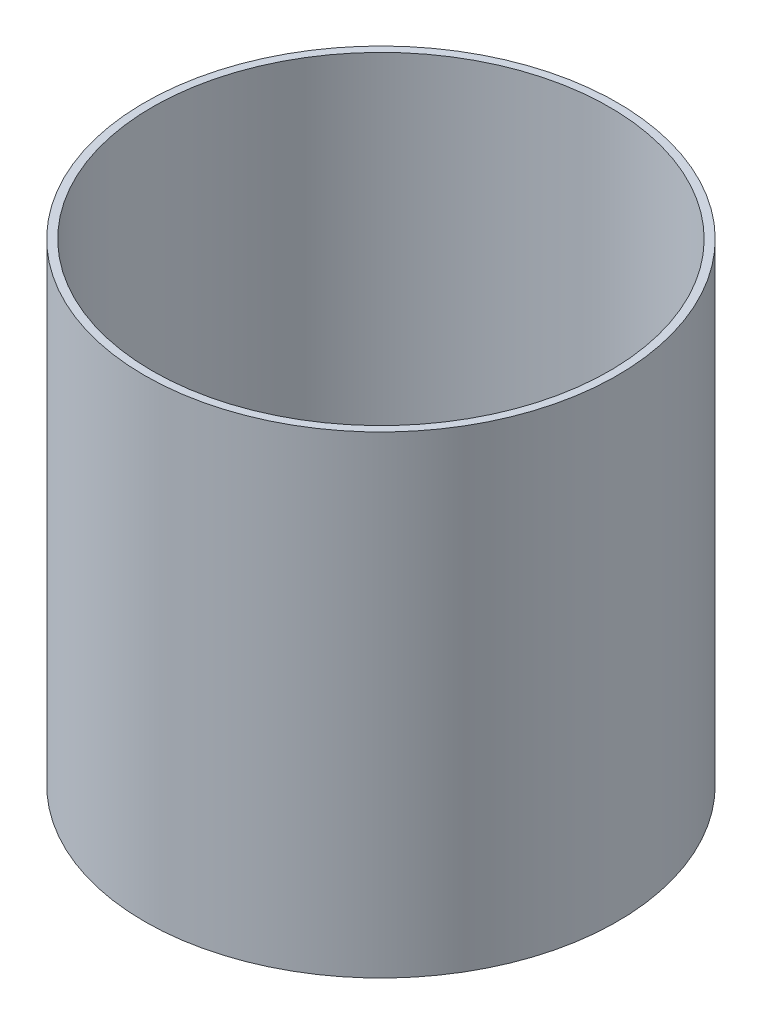
ISO-10303-21;
HEADER;
FILE_DESCRIPTION(('STEP AP214'),'2;1');
FILE_NAME('part.step','',(''),(''),'','','');
FILE_SCHEMA(('AUTOMOTIVE_DESIGN { 1 0 10303 214 1 1 1 1 }'));
ENDSEC;
DATA;
#1=APPLICATION_CONTEXT('core data for automotive mechanical design processes');
#2=APPLICATION_PROTOCOL_DEFINITION('international standard','automotive_design',2000,#1);
#3=PRODUCT_CONTEXT('',#1,'mechanical');
#4=PRODUCT('Part','Part','',(#3));
#5=PRODUCT_RELATED_PRODUCT_CATEGORY('part','',(#4));
#6=PRODUCT_DEFINITION_FORMATION('','',#4);
#7=PRODUCT_DEFINITION_CONTEXT('part definition',#1,'design');
#8=PRODUCT_DEFINITION('design','',#6,#7);
#9=PRODUCT_DEFINITION_SHAPE('','',#8);
#10=(LENGTH_UNIT() NAMED_UNIT(*) SI_UNIT(.MILLI.,.METRE.));
#11=(NAMED_UNIT(*) PLANE_ANGLE_UNIT() SI_UNIT($,.RADIAN.));
#12=(NAMED_UNIT(*) SI_UNIT($,.STERADIAN.) SOLID_ANGLE_UNIT());
#13=UNCERTAINTY_MEASURE_WITH_UNIT(LENGTH_MEASURE(1.E-05),#10,'distance_accuracy_value','');
#14=(GEOMETRIC_REPRESENTATION_CONTEXT(3) GLOBAL_UNCERTAINTY_ASSIGNED_CONTEXT((#13)) GLOBAL_UNIT_ASSIGNED_CONTEXT((#10,
#11,#12)) REPRESENTATION_CONTEXT('',''));
#15=CARTESIAN_POINT('',(0.,0.,0.));
#16=DIRECTION('',(0.,0.,1.));
#17=DIRECTION('',(1.,0.,0.));
#18=AXIS2_PLACEMENT_3D('',#15,#16,#17);
#19=CARTESIAN_POINT('',(0.,152.4,0.));
#20=DIRECTION('',(0.,1.,0.));
#21=DIRECTION('',(0.,0.,1.));
#22=AXIS2_PLACEMENT_3D('',#19,#20,#21);
#23=PLANE('',#22);
#24=CARTESIAN_POINT('',(0.,152.4,0.));
#25=DIRECTION('',(0.,1.,0.));
#26=DIRECTION('',(0.,0.,1.));
#27=AXIS2_PLACEMENT_3D('',#24,#25,#26);
#28=CIRCLE('',#27,76.1746);
#29=CARTESIAN_POINT('',(0.,152.4,76.1746));
#30=VERTEX_POINT('',#29);
#31=EDGE_CURVE('E10',#30,#30,#28,.T.);
#32=ORIENTED_EDGE('',*,*,#31,.T.);
#33=EDGE_LOOP('',(#32));
#34=FACE_BOUND('',#33,.T.);
#35=CARTESIAN_POINT('',(0.,152.4,0.));
#36=DIRECTION('',(0.,1.,0.));
#37=DIRECTION('',(0.,0.,1.));
#38=AXIS2_PLACEMENT_3D('',#35,#36,#37);
#39=CIRCLE('',#38,73.66);
#40=CARTESIAN_POINT('',(0.,152.4,73.66));
#41=VERTEX_POINT('',#40);
#42=EDGE_CURVE('E45',#41,#41,#39,.T.);
#43=ORIENTED_EDGE('',*,*,#42,.F.);
#44=EDGE_LOOP('',(#43));
#45=FACE_BOUND('',#44,.T.);
#46=ADVANCED_FACE('F34',(#34,#45),#23,.T.);
#47=CARTESIAN_POINT('',(0.,0.,0.));
#48=DIRECTION('',(0.,1.,0.));
#49=DIRECTION('',(0.,0.,1.));
#50=AXIS2_PLACEMENT_3D('',#47,#48,#49);
#51=PLANE('',#50);
#52=CARTESIAN_POINT('',(0.,0.,0.));
#53=DIRECTION('',(0.,1.,0.));
#54=DIRECTION('',(0.,0.,1.));
#55=AXIS2_PLACEMENT_3D('',#52,#53,#54);
#56=CIRCLE('',#55,76.1746);
#57=CARTESIAN_POINT('',(0.,0.,76.1746));
#58=VERTEX_POINT('',#57);
#59=EDGE_CURVE('E38',#58,#58,#56,.T.);
#60=ORIENTED_EDGE('',*,*,#59,.F.);
#61=EDGE_LOOP('',(#60));
#62=FACE_BOUND('',#61,.T.);
#63=CARTESIAN_POINT('',(0.,0.,0.));
#64=DIRECTION('',(0.,1.,0.));
#65=DIRECTION('',(0.,0.,1.));
#66=AXIS2_PLACEMENT_3D('',#63,#64,#65);
#67=CIRCLE('',#66,73.66);
#68=CARTESIAN_POINT('',(0.,0.,73.66));
#69=VERTEX_POINT('',#68);
#70=EDGE_CURVE('E47',#69,#69,#67,.T.);
#71=ORIENTED_EDGE('',*,*,#70,.T.);
#72=EDGE_LOOP('',(#71));
#73=FACE_BOUND('',#72,.T.);
#74=ADVANCED_FACE('F57',(#62,#73),#51,.F.);
#75=CARTESIAN_POINT('',(0.,152.4,0.));
#76=DIRECTION('',(0.,-1.,0.));
#77=DIRECTION('',(0.,0.,-1.));
#78=AXIS2_PLACEMENT_3D('',#75,#76,#77);
#79=CYLINDRICAL_SURFACE('',#78,76.1746);
#80=ORIENTED_EDGE('',*,*,#31,.F.);
#81=EDGE_LOOP('',(#80));
#82=FACE_BOUND('',#81,.T.);
#83=ORIENTED_EDGE('',*,*,#59,.T.);
#84=EDGE_LOOP('',(#83));
#85=FACE_BOUND('',#84,.T.);
#86=ADVANCED_FACE('F36',(#82,#85),#79,.T.);
#87=CARTESIAN_POINT('',(0.,152.4,0.));
#88=DIRECTION('',(0.,-1.,0.));
#89=DIRECTION('',(0.,0.,-1.));
#90=AXIS2_PLACEMENT_3D('',#87,#88,#89);
#91=CYLINDRICAL_SURFACE('',#90,73.66);
#92=ORIENTED_EDGE('',*,*,#42,.T.);
#93=EDGE_LOOP('',(#92));
#94=FACE_BOUND('',#93,.T.);
#95=ORIENTED_EDGE('',*,*,#70,.F.);
#96=EDGE_LOOP('',(#95));
#97=FACE_BOUND('',#96,.T.);
#98=ADVANCED_FACE('F53',(#94,#97),#91,.F.);
#99=CLOSED_SHELL('',(#46,#74,#86,#98));
#100=MANIFOLD_SOLID_BREP('B2',#99);
#101=ADVANCED_BREP_SHAPE_REPRESENTATION('',(#18,#100),#14);
#102=SHAPE_DEFINITION_REPRESENTATION(#9,#101);
ENDSEC;
END-ISO-10303-21;
